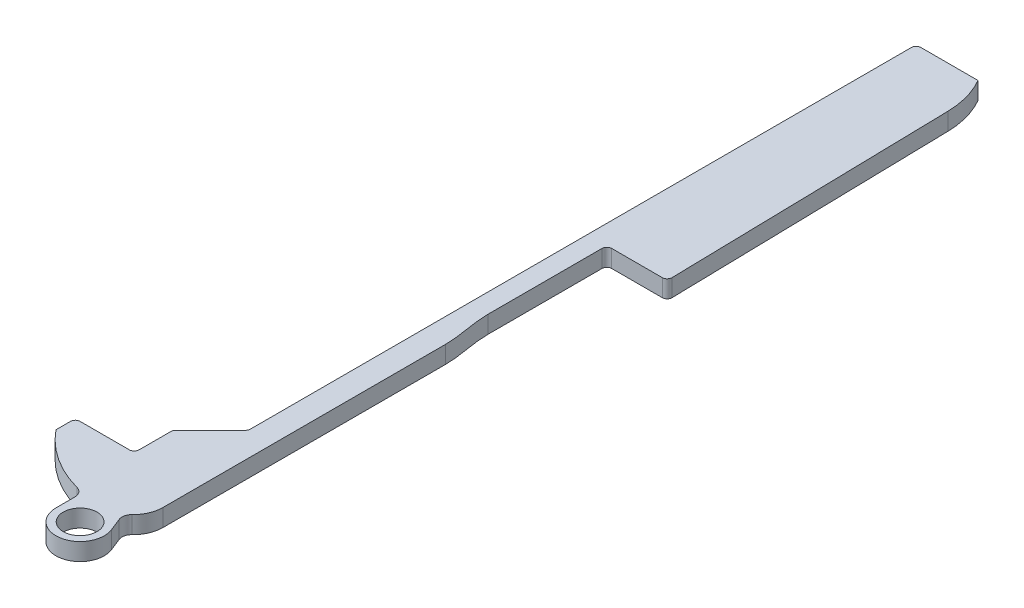
ISO-10303-21;
HEADER;
FILE_DESCRIPTION(('STEP AP214'),'2;1');
FILE_NAME('part.step','',(''),(''),'','','');
FILE_SCHEMA(('AUTOMOTIVE_DESIGN { 1 0 10303 214 1 1 1 1 }'));
ENDSEC;
DATA;
#1=APPLICATION_CONTEXT('core data for automotive mechanical design processes');
#2=APPLICATION_PROTOCOL_DEFINITION('international standard','automotive_design',2000,#1);
#3=PRODUCT_CONTEXT('',#1,'mechanical');
#4=PRODUCT('Part','Part','',(#3));
#5=PRODUCT_RELATED_PRODUCT_CATEGORY('part','',(#4));
#6=PRODUCT_DEFINITION_FORMATION('','',#4);
#7=PRODUCT_DEFINITION_CONTEXT('part definition',#1,'design');
#8=PRODUCT_DEFINITION('design','',#6,#7);
#9=PRODUCT_DEFINITION_SHAPE('','',#8);
#10=(LENGTH_UNIT() NAMED_UNIT(*) SI_UNIT(.MILLI.,.METRE.));
#11=(NAMED_UNIT(*) PLANE_ANGLE_UNIT() SI_UNIT($,.RADIAN.));
#12=(NAMED_UNIT(*) SI_UNIT($,.STERADIAN.) SOLID_ANGLE_UNIT());
#13=UNCERTAINTY_MEASURE_WITH_UNIT(LENGTH_MEASURE(1.E-05),#10,'distance_accuracy_value','');
#14=(GEOMETRIC_REPRESENTATION_CONTEXT(3) GLOBAL_UNCERTAINTY_ASSIGNED_CONTEXT((#13)) GLOBAL_UNIT_ASSIGNED_CONTEXT((#10,
#11,#12)) REPRESENTATION_CONTEXT('',''));
#15=CARTESIAN_POINT('',(0.,0.,0.));
#16=DIRECTION('',(0.,0.,1.));
#17=DIRECTION('',(1.,0.,0.));
#18=AXIS2_PLACEMENT_3D('',#15,#16,#17);
#19=CARTESIAN_POINT('',(9.43,1.8,-12.1305444444443));
#20=DIRECTION('',(0.,-1.,0.));
#21=DIRECTION('',(0.,0.,-1.));
#22=AXIS2_PLACEMENT_3D('',#19,#20,#21);
#23=CYLINDRICAL_SURFACE('',#22,12.1305444444443);
#24=CARTESIAN_POINT('',(9.43,0.,-12.1305444444443));
#25=DIRECTION('',(0.,1.,0.));
#26=DIRECTION('',(0.,0.,-1.));
#27=AXIS2_PLACEMENT_3D('',#24,#25,#26);
#28=CIRCLE('',#27,12.1305444444443);
#29=CARTESIAN_POINT('',(0.,0.,-4.5));
#30=VERTEX_POINT('',#29);
#31=CARTESIAN_POINT('',(6.2612229838993,0.,-0.421190886673872));
#32=VERTEX_POINT('',#31);
#33=EDGE_CURVE('E242',#30,#32,#28,.T.);
#34=ORIENTED_EDGE('',*,*,#33,.T.);
#35=DIRECTION('',(0.,-1.,0.));
#36=VECTOR('',#35,1.);
#37=CARTESIAN_POINT('',(6.2612229838993,1.8,-0.42119088667387));
#38=LINE('',#37,#36);
#39=CARTESIAN_POINT('',(6.2612229838993,1.8,-0.421190886673872));
#40=VERTEX_POINT('',#39);
#41=EDGE_CURVE('E326',#32,#40,#38,.F.);
#42=ORIENTED_EDGE('',*,*,#41,.T.);
#43=CARTESIAN_POINT('',(9.43,1.8,-12.1305444444443));
#44=DIRECTION('',(0.,1.,0.));
#45=DIRECTION('',(0.,0.,-1.));
#46=AXIS2_PLACEMENT_3D('',#43,#44,#45);
#47=CIRCLE('',#46,12.1305444444443);
#48=CARTESIAN_POINT('',(0.,1.8,-4.5));
#49=VERTEX_POINT('',#48);
#50=EDGE_CURVE('E244',#49,#40,#47,.T.);
#51=ORIENTED_EDGE('',*,*,#50,.F.);
#52=DIRECTION('',(0.,-1.,0.));
#53=VECTOR('',#52,1.);
#54=CARTESIAN_POINT('',(0.,1.8,-4.5));
#55=LINE('',#54,#53);
#56=EDGE_CURVE('E417',#49,#30,#55,.T.);
#57=ORIENTED_EDGE('',*,*,#56,.T.);
#58=EDGE_LOOP('',(#34,#42,#51,#57));
#59=FACE_BOUND('',#58,.T.);
#60=ADVANCED_FACE('F35',(#59),#23,.T.);
#61=CARTESIAN_POINT('',(9.43,1.8,-3.07));
#62=DIRECTION('',(0.,-1.,0.));
#63=DIRECTION('',(0.,0.,-1.));
#64=AXIS2_PLACEMENT_3D('',#61,#62,#63);
#65=CYLINDRICAL_SURFACE('',#64,3.07);
#66=CARTESIAN_POINT('',(9.43,1.8,-3.07));
#67=DIRECTION('',(0.,1.,0.));
#68=DIRECTION('',(0.,0.,-1.));
#69=AXIS2_PLACEMENT_3D('',#66,#67,#68);
#70=CIRCLE('',#69,3.07);
#71=CARTESIAN_POINT('',(11.5409002213602,1.8,-0.840874553673195));
#72=VERTEX_POINT('',#71);
#73=CARTESIAN_POINT('',(12.5,1.8,-3.07));
#74=VERTEX_POINT('',#73);
#75=EDGE_CURVE('E246',#72,#74,#70,.T.);
#76=ORIENTED_EDGE('',*,*,#75,.F.);
#77=DIRECTION('',(0.,-1.,0.));
#78=VECTOR('',#77,1.);
#79=CARTESIAN_POINT('',(11.5409002213602,1.8,-0.840874553673194));
#80=LINE('',#79,#78);
#81=CARTESIAN_POINT('',(11.5409002213602,0.,-0.840874553673195));
#82=VERTEX_POINT('',#81);
#83=EDGE_CURVE('E334',#72,#82,#80,.T.);
#84=ORIENTED_EDGE('',*,*,#83,.T.);
#85=CARTESIAN_POINT('',(9.43,0.,-3.07));
#86=DIRECTION('',(0.,1.,0.));
#87=DIRECTION('',(0.,0.,-1.));
#88=AXIS2_PLACEMENT_3D('',#85,#86,#87);
#89=CIRCLE('',#88,3.07);
#90=CARTESIAN_POINT('',(12.5,0.,-3.07));
#91=VERTEX_POINT('',#90);
#92=EDGE_CURVE('E456',#82,#91,#89,.T.);
#93=ORIENTED_EDGE('',*,*,#92,.T.);
#94=DIRECTION('',(0.,-1.,0.));
#95=VECTOR('',#94,1.);
#96=CARTESIAN_POINT('',(12.5,1.8,-3.07));
#97=LINE('',#96,#95);
#98=EDGE_CURVE('E402',#74,#91,#97,.T.);
#99=ORIENTED_EDGE('',*,*,#98,.F.);
#100=EDGE_LOOP('',(#76,#84,#93,#99));
#101=FACE_BOUND('',#100,.T.);
#102=ADVANCED_FACE('F272',(#101),#65,.T.);
#103=CARTESIAN_POINT('',(12.5,1.8,-32.33));
#104=DIRECTION('',(-1.,0.,0.));
#105=DIRECTION('',(0.,0.,1.));
#106=AXIS2_PLACEMENT_3D('',#103,#104,#105);
#107=PLANE('',#106);
#108=DIRECTION('',(0.,0.,-1.));
#109=VECTOR('',#108,1.);
#110=CARTESIAN_POINT('',(12.5,0.,-32.33));
#111=LINE('',#110,#109);
#112=CARTESIAN_POINT('',(12.5,0.,-32.33));
#113=VERTEX_POINT('',#112);
#114=EDGE_CURVE('E451',#91,#113,#111,.T.);
#115=ORIENTED_EDGE('',*,*,#114,.T.);
#116=DIRECTION('',(0.,-1.,0.));
#117=VECTOR('',#116,1.);
#118=CARTESIAN_POINT('',(12.5,1.8,-32.33));
#119=LINE('',#118,#117);
#120=CARTESIAN_POINT('',(12.5,1.8,-32.33));
#121=VERTEX_POINT('',#120);
#122=EDGE_CURVE('E405',#121,#113,#119,.T.);
#123=ORIENTED_EDGE('',*,*,#122,.F.);
#124=DIRECTION('',(0.,0.,-1.));
#125=VECTOR('',#124,1.);
#126=CARTESIAN_POINT('',(12.5,1.8,-32.33));
#127=LINE('',#126,#125);
#128=EDGE_CURVE('E249',#74,#121,#127,.T.);
#129=ORIENTED_EDGE('',*,*,#128,.F.);
#130=ORIENTED_EDGE('',*,*,#98,.T.);
#131=EDGE_LOOP('',(#115,#123,#129,#130));
#132=FACE_BOUND('',#131,.T.);
#133=ADVANCED_FACE('F267',(#132),#107,.F.);
#134=CARTESIAN_POINT('',(12.5,1.8,-32.33));
#135=CARTESIAN_POINT('',(12.5,1.8,-33.9722823380889));
#136=CARTESIAN_POINT('',(12.,1.8,-35.554764974261));
#137=CARTESIAN_POINT('',(12.,1.8,-37.18));
#138=B_SPLINE_CURVE_WITH_KNOTS('',3,(#134,#135,#136,#137),.UNSPECIFIED.,.F.,.F.,(4,4),(0.,1.),.UNSPECIFIED.);
#139=DIRECTION('',(0.,-1.,0.));
#140=VECTOR('',#139,1.);
#141=SURFACE_OF_LINEAR_EXTRUSION('',#138,#140);
#142=CARTESIAN_POINT('',(12.5,0.,-32.33));
#143=CARTESIAN_POINT('',(12.5,0.,-33.9722823380889));
#144=CARTESIAN_POINT('',(12.,0.,-35.554764974261));
#145=CARTESIAN_POINT('',(12.,0.,-37.18));
#146=B_SPLINE_CURVE_WITH_KNOTS('',3,(#142,#143,#144,#145),.UNSPECIFIED.,.F.,.F.,(4,4),(0.,1.),.UNSPECIFIED.);
#147=CARTESIAN_POINT('',(12.,0.,-37.18));
#148=VERTEX_POINT('',#147);
#149=EDGE_CURVE('E447',#113,#148,#146,.T.);
#150=ORIENTED_EDGE('',*,*,#149,.T.);
#151=DIRECTION('',(0.,-1.,0.));
#152=VECTOR('',#151,1.);
#153=CARTESIAN_POINT('',(12.,1.8,-37.18));
#154=LINE('',#153,#152);
#155=CARTESIAN_POINT('',(12.,1.8,-37.18));
#156=VERTEX_POINT('',#155);
#157=EDGE_CURVE('E408',#156,#148,#154,.T.);
#158=ORIENTED_EDGE('',*,*,#157,.F.);
#159=EDGE_CURVE('E251',#121,#156,#138,.T.);
#160=ORIENTED_EDGE('',*,*,#159,.F.);
#161=ORIENTED_EDGE('',*,*,#122,.T.);
#162=EDGE_LOOP('',(#150,#158,#160,#161));
#163=FACE_BOUND('',#162,.T.);
#164=ADVANCED_FACE('F262',(#163),#141,.F.);
#165=CARTESIAN_POINT('',(12.,1.8,-37.18));
#166=DIRECTION('',(-1.,0.,0.));
#167=DIRECTION('',(0.,0.,1.));
#168=AXIS2_PLACEMENT_3D('',#165,#166,#167);
#169=PLANE('',#168);
#170=DIRECTION('',(0.,0.,-1.));
#171=VECTOR('',#170,1.);
#172=CARTESIAN_POINT('',(12.,0.,-37.18));
#173=LINE('',#172,#171);
#174=CARTESIAN_POINT('',(12.,0.,-49.));
#175=VERTEX_POINT('',#174);
#176=EDGE_CURVE('E444',#148,#175,#173,.T.);
#177=ORIENTED_EDGE('',*,*,#176,.T.);
#178=DIRECTION('',(0.,-1.,0.));
#179=VECTOR('',#178,1.);
#180=CARTESIAN_POINT('',(12.,1.8,-49.));
#181=LINE('',#180,#179);
#182=CARTESIAN_POINT('',(12.,1.8,-49.));
#183=VERTEX_POINT('',#182);
#184=EDGE_CURVE('E395',#175,#183,#181,.F.);
#185=ORIENTED_EDGE('',*,*,#184,.T.);
#186=DIRECTION('',(0.,0.,-1.));
#187=VECTOR('',#186,1.);
#188=CARTESIAN_POINT('',(12.,1.8,-37.18));
#189=LINE('',#188,#187);
#190=EDGE_CURVE('E256',#156,#183,#189,.T.);
#191=ORIENTED_EDGE('',*,*,#190,.F.);
#192=ORIENTED_EDGE('',*,*,#157,.T.);
#193=EDGE_LOOP('',(#177,#185,#191,#192));
#194=FACE_BOUND('',#193,.T.);
#195=ADVANCED_FACE('F266',(#194),#169,.F.);
#196=CARTESIAN_POINT('',(18.25,1.8,-49.5));
#197=DIRECTION('',(0.,0.,-1.));
#198=DIRECTION('',(-1.,0.,0.));
#199=AXIS2_PLACEMENT_3D('',#196,#197,#198);
#200=PLANE('',#199);
#201=DIRECTION('',(1.,0.,0.));
#202=VECTOR('',#201,1.);
#203=CARTESIAN_POINT('',(18.25,1.8,-49.5));
#204=LINE('',#203,#202);
#205=CARTESIAN_POINT('',(12.5,1.8,-49.5));
#206=VERTEX_POINT('',#205);
#207=CARTESIAN_POINT('',(17.7389709464066,1.8,-49.5));
#208=VERTEX_POINT('',#207);
#209=EDGE_CURVE('E478',#206,#208,#204,.T.);
#210=ORIENTED_EDGE('',*,*,#209,.F.);
#211=DIRECTION('',(0.,-1.,0.));
#212=VECTOR('',#211,1.);
#213=CARTESIAN_POINT('',(12.5,0.,-49.5));
#214=LINE('',#213,#212);
#215=CARTESIAN_POINT('',(12.5,0.,-49.5));
#216=VERTEX_POINT('',#215);
#217=EDGE_CURVE('E397',#206,#216,#214,.T.);
#218=ORIENTED_EDGE('',*,*,#217,.T.);
#219=DIRECTION('',(1.,0.,0.));
#220=VECTOR('',#219,1.);
#221=CARTESIAN_POINT('',(18.25,0.,-49.5));
#222=LINE('',#221,#220);
#223=CARTESIAN_POINT('',(17.7389709464066,0.,-49.5));
#224=VERTEX_POINT('',#223);
#225=EDGE_CURVE('E441',#216,#224,#222,.T.);
#226=ORIENTED_EDGE('',*,*,#225,.T.);
#227=DIRECTION('',(0.,-1.,0.));
#228=VECTOR('',#227,1.);
#229=CARTESIAN_POINT('',(17.7389709464066,1.8,-49.5));
#230=LINE('',#229,#228);
#231=EDGE_CURVE('E400',#224,#208,#230,.F.);
#232=ORIENTED_EDGE('',*,*,#231,.T.);
#233=EDGE_LOOP('',(#210,#218,#226,#232));
#234=FACE_BOUND('',#233,.T.);
#235=ADVANCED_FACE('F492',(#234),#200,.F.);
#236=CARTESIAN_POINT('',(17.6019605823982,1.8,-79.1992260441899));
#237=DIRECTION('',(-0.999762027079909,0.,0.0218148850345542));
#238=DIRECTION('',(0.0218148850345542,0.,0.999762027079909));
#239=AXIS2_PLACEMENT_3D('',#236,#237,#238);
#240=PLANE('',#239);
#241=DIRECTION('',(-0.0218148850345542,0.,-0.999762027079909));
#242=VECTOR('',#241,1.);
#243=CARTESIAN_POINT('',(17.6019605823982,1.8,-79.1992260441899));
#244=LINE('',#243,#242);
#245=CARTESIAN_POINT('',(18.2388519599465,1.8,-50.0109074425173));
#246=VERTEX_POINT('',#245);
#247=CARTESIAN_POINT('',(17.6019605823982,1.8,-79.1992260441899));
#248=VERTEX_POINT('',#247);
#249=EDGE_CURVE('E477',#246,#248,#244,.T.);
#250=ORIENTED_EDGE('',*,*,#249,.F.);
#251=DIRECTION('',(0.,-1.,0.));
#252=VECTOR('',#251,1.);
#253=CARTESIAN_POINT('',(18.2388519599465,1.8,-50.0109074425173));
#254=LINE('',#253,#252);
#255=CARTESIAN_POINT('',(18.2388519599465,0.,-50.0109074425173));
#256=VERTEX_POINT('',#255);
#257=EDGE_CURVE('E392',#246,#256,#254,.T.);
#258=ORIENTED_EDGE('',*,*,#257,.T.);
#259=DIRECTION('',(-0.0218148850345542,0.,-0.999762027079909));
#260=VECTOR('',#259,1.);
#261=CARTESIAN_POINT('',(17.6019605823982,0.,-79.1992260441899));
#262=LINE('',#261,#260);
#263=CARTESIAN_POINT('',(17.6019605823982,0.,-79.1992260441899));
#264=VERTEX_POINT('',#263);
#265=EDGE_CURVE('E439',#256,#264,#262,.T.);
#266=ORIENTED_EDGE('',*,*,#265,.T.);
#267=DIRECTION('',(0.,-1.,0.));
#268=VECTOR('',#267,1.);
#269=CARTESIAN_POINT('',(17.6019605823982,1.8,-79.1992260441899));
#270=LINE('',#269,#268);
#271=EDGE_CURVE('E411',#248,#264,#270,.T.);
#272=ORIENTED_EDGE('',*,*,#271,.F.);
#273=EDGE_LOOP('',(#250,#258,#266,#272));
#274=FACE_BOUND('',#273,.T.);
#275=ADVANCED_FACE('F501',(#274),#240,.F.);
#276=CARTESIAN_POINT('',(8.60410233867904,1.8,-79.0028920788789));
#277=DIRECTION('',(0.,-1.,0.));
#278=DIRECTION('',(0.,0.,-1.));
#279=AXIS2_PLACEMENT_3D('',#276,#277,#278);
#280=CYLINDRICAL_SURFACE('',#279,9.);
#281=CARTESIAN_POINT('',(8.60410233867904,0.,-79.0028920788789));
#282=DIRECTION('',(0.,1.,0.));
#283=DIRECTION('',(0.,0.,1.));
#284=AXIS2_PLACEMENT_3D('',#281,#282,#283);
#285=CIRCLE('',#284,9.);
#286=CARTESIAN_POINT('',(16.4,0.,-83.5));
#287=VERTEX_POINT('',#286);
#288=EDGE_CURVE('E437',#264,#287,#285,.T.);
#289=ORIENTED_EDGE('',*,*,#288,.T.);
#290=DIRECTION('',(0.,-1.,0.));
#291=VECTOR('',#290,1.);
#292=CARTESIAN_POINT('',(16.4,1.8,-83.5));
#293=LINE('',#292,#291);
#294=CARTESIAN_POINT('',(16.4,1.8,-83.5));
#295=VERTEX_POINT('',#294);
#296=EDGE_CURVE('E414',#295,#287,#293,.T.);
#297=ORIENTED_EDGE('',*,*,#296,.F.);
#298=CARTESIAN_POINT('',(8.60410233867904,1.8,-79.0028920788789));
#299=DIRECTION('',(0.,1.,0.));
#300=DIRECTION('',(0.,0.,1.));
#301=AXIS2_PLACEMENT_3D('',#298,#299,#300);
#302=CIRCLE('',#301,9.);
#303=EDGE_CURVE('E475',#248,#295,#302,.T.);
#304=ORIENTED_EDGE('',*,*,#303,.F.);
#305=ORIENTED_EDGE('',*,*,#271,.T.);
#306=EDGE_LOOP('',(#289,#297,#304,#305));
#307=FACE_BOUND('',#306,.T.);
#308=ADVANCED_FACE('F508',(#307),#280,.T.);
#309=CARTESIAN_POINT('',(10.,1.8,-83.5));
#310=DIRECTION('',(0.,0.,1.));
#311=DIRECTION('',(1.,0.,0.));
#312=AXIS2_PLACEMENT_3D('',#309,#310,#311);
#313=PLANE('',#312);
#314=DIRECTION('',(-1.,0.,0.));
#315=VECTOR('',#314,1.);
#316=CARTESIAN_POINT('',(10.,0.,-83.5));
#317=LINE('',#316,#315);
#318=CARTESIAN_POINT('',(10.5,0.,-83.5));
#319=VERTEX_POINT('',#318);
#320=EDGE_CURVE('E434',#287,#319,#317,.T.);
#321=ORIENTED_EDGE('',*,*,#320,.T.);
#322=DIRECTION('',(0.,-1.,0.));
#323=VECTOR('',#322,1.);
#324=CARTESIAN_POINT('',(10.5,1.8,-83.5));
#325=LINE('',#324,#323);
#326=CARTESIAN_POINT('',(10.5,1.8,-83.5));
#327=VERTEX_POINT('',#326);
#328=EDGE_CURVE('E354',#319,#327,#325,.F.);
#329=ORIENTED_EDGE('',*,*,#328,.T.);
#330=DIRECTION('',(-1.,0.,0.));
#331=VECTOR('',#330,1.);
#332=CARTESIAN_POINT('',(10.,1.8,-83.5));
#333=LINE('',#332,#331);
#334=EDGE_CURVE('E472',#295,#327,#333,.T.);
#335=ORIENTED_EDGE('',*,*,#334,.F.);
#336=ORIENTED_EDGE('',*,*,#296,.T.);
#337=EDGE_LOOP('',(#321,#329,#335,#336));
#338=FACE_BOUND('',#337,.T.);
#339=ADVANCED_FACE('F511',(#338),#313,.F.);
#340=CARTESIAN_POINT('',(10.,1.8,-14.4));
#341=DIRECTION('',(1.,0.,0.));
#342=DIRECTION('',(0.,0.,-1.));
#343=AXIS2_PLACEMENT_3D('',#340,#341,#342);
#344=PLANE('',#343);
#345=DIRECTION('',(0.,0.,1.));
#346=VECTOR('',#345,1.);
#347=CARTESIAN_POINT('',(10.,0.,-14.4));
#348=LINE('',#347,#346);
#349=CARTESIAN_POINT('',(10.,0.,-83.));
#350=VERTEX_POINT('',#349);
#351=CARTESIAN_POINT('',(10.,0.,-14.6071067811865));
#352=VERTEX_POINT('',#351);
#353=EDGE_CURVE('E431',#350,#352,#348,.T.);
#354=ORIENTED_EDGE('',*,*,#353,.T.);
#355=DIRECTION('',(0.,-1.,0.));
#356=VECTOR('',#355,1.);
#357=CARTESIAN_POINT('',(10.,1.8,-14.6071067811865));
#358=LINE('',#357,#356);
#359=CARTESIAN_POINT('',(10.,1.8,-14.6071067811865));
#360=VERTEX_POINT('',#359);
#361=EDGE_CURVE('E366',#352,#360,#358,.F.);
#362=ORIENTED_EDGE('',*,*,#361,.T.);
#363=DIRECTION('',(0.,0.,1.));
#364=VECTOR('',#363,1.);
#365=CARTESIAN_POINT('',(10.,1.8,-14.4));
#366=LINE('',#365,#364);
#367=CARTESIAN_POINT('',(10.,1.8,-83.));
#368=VERTEX_POINT('',#367);
#369=EDGE_CURVE('E469',#368,#360,#366,.T.);
#370=ORIENTED_EDGE('',*,*,#369,.F.);
#371=DIRECTION('',(0.,-1.,0.));
#372=VECTOR('',#371,1.);
#373=CARTESIAN_POINT('',(10.,1.8,-83.));
#374=LINE('',#373,#372);
#375=EDGE_CURVE('E368',#368,#350,#374,.T.);
#376=ORIENTED_EDGE('',*,*,#375,.T.);
#377=EDGE_LOOP('',(#354,#362,#370,#376));
#378=FACE_BOUND('',#377,.T.);
#379=ADVANCED_FACE('F517',(#378),#344,.F.);
#380=CARTESIAN_POINT('',(6.1,1.8,-10.5));
#381=DIRECTION('',(0.707106781186546,0.,0.707106781186549));
#382=DIRECTION('',(0.707106781186549,0.,-0.707106781186546));
#383=AXIS2_PLACEMENT_3D('',#380,#381,#382);
#384=PLANE('',#383);
#385=DIRECTION('',(-0.707106781186549,0.,0.707106781186546));
#386=VECTOR('',#385,1.);
#387=CARTESIAN_POINT('',(6.1,1.8,-10.5));
#388=LINE('',#387,#386);
#389=CARTESIAN_POINT('',(9.85355339059327,1.8,-14.2535533905933));
#390=VERTEX_POINT('',#389);
#391=CARTESIAN_POINT('',(6.24644660940673,1.8,-10.6464466094067));
#392=VERTEX_POINT('',#391);
#393=EDGE_CURVE('E466',#390,#392,#388,.T.);
#394=ORIENTED_EDGE('',*,*,#393,.F.);
#395=DIRECTION('',(0.,-1.,0.));
#396=VECTOR('',#395,1.);
#397=CARTESIAN_POINT('',(9.85355339059327,0.,-14.2535533905933));
#398=LINE('',#397,#396);
#399=CARTESIAN_POINT('',(9.85355339059327,0.,-14.2535533905933));
#400=VERTEX_POINT('',#399);
#401=EDGE_CURVE('E371',#390,#400,#398,.T.);
#402=ORIENTED_EDGE('',*,*,#401,.T.);
#403=DIRECTION('',(-0.707106781186549,0.,0.707106781186546));
#404=VECTOR('',#403,1.);
#405=CARTESIAN_POINT('',(6.1,0.,-10.5));
#406=LINE('',#405,#404);
#407=CARTESIAN_POINT('',(6.24644660940673,0.,-10.6464466094067));
#408=VERTEX_POINT('',#407);
#409=EDGE_CURVE('E428',#400,#408,#406,.T.);
#410=ORIENTED_EDGE('',*,*,#409,.T.);
#411=DIRECTION('',(0.,-1.,0.));
#412=VECTOR('',#411,1.);
#413=CARTESIAN_POINT('',(6.24644660940673,1.8,-10.6464466094067));
#414=LINE('',#413,#412);
#415=EDGE_CURVE('E374',#408,#392,#414,.F.);
#416=ORIENTED_EDGE('',*,*,#415,.T.);
#417=EDGE_LOOP('',(#394,#402,#410,#416));
#418=FACE_BOUND('',#417,.T.);
#419=ADVANCED_FACE('F524',(#418),#384,.F.);
#420=CARTESIAN_POINT('',(6.1,1.8,-6.5));
#421=DIRECTION('',(1.,0.,0.));
#422=DIRECTION('',(0.,0.,-1.));
#423=AXIS2_PLACEMENT_3D('',#420,#421,#422);
#424=PLANE('',#423);
#425=DIRECTION('',(0.,0.,1.));
#426=VECTOR('',#425,1.);
#427=CARTESIAN_POINT('',(6.1,1.8,-6.5));
#428=LINE('',#427,#426);
#429=CARTESIAN_POINT('',(6.1,1.8,-10.2928932188135));
#430=VERTEX_POINT('',#429);
#431=CARTESIAN_POINT('',(6.1,1.8,-7.));
#432=VERTEX_POINT('',#431);
#433=EDGE_CURVE('E463',#430,#432,#428,.T.);
#434=ORIENTED_EDGE('',*,*,#433,.F.);
#435=DIRECTION('',(0.,-1.,0.));
#436=VECTOR('',#435,1.);
#437=CARTESIAN_POINT('',(6.1,1.8,-10.2928932188135));
#438=LINE('',#437,#436);
#439=CARTESIAN_POINT('',(6.1,0.,-10.2928932188135));
#440=VERTEX_POINT('',#439);
#441=EDGE_CURVE('E361',#430,#440,#438,.T.);
#442=ORIENTED_EDGE('',*,*,#441,.T.);
#443=DIRECTION('',(0.,0.,1.));
#444=VECTOR('',#443,1.);
#445=CARTESIAN_POINT('',(6.1,0.,-6.5));
#446=LINE('',#445,#444);
#447=CARTESIAN_POINT('',(6.1,0.,-7.));
#448=VERTEX_POINT('',#447);
#449=EDGE_CURVE('E425',#440,#448,#446,.T.);
#450=ORIENTED_EDGE('',*,*,#449,.T.);
#451=DIRECTION('',(0.,-1.,0.));
#452=VECTOR('',#451,1.);
#453=CARTESIAN_POINT('',(6.1,1.8,-7.));
#454=LINE('',#453,#452);
#455=EDGE_CURVE('E364',#448,#432,#454,.F.);
#456=ORIENTED_EDGE('',*,*,#455,.T.);
#457=EDGE_LOOP('',(#434,#442,#450,#456));
#458=FACE_BOUND('',#457,.T.);
#459=ADVANCED_FACE('F531',(#458),#424,.F.);
#460=CARTESIAN_POINT('',(0.,1.8,-6.5));
#461=DIRECTION('',(0.,0.,1.));
#462=DIRECTION('',(1.,0.,0.));
#463=AXIS2_PLACEMENT_3D('',#460,#461,#462);
#464=PLANE('',#463);
#465=DIRECTION('',(-1.,0.,0.));
#466=VECTOR('',#465,1.);
#467=CARTESIAN_POINT('',(0.,1.8,-6.5));
#468=LINE('',#467,#466);
#469=CARTESIAN_POINT('',(5.6,1.8,-6.5));
#470=VERTEX_POINT('',#469);
#471=CARTESIAN_POINT('',(0.5,1.8,-6.5));
#472=VERTEX_POINT('',#471);
#473=EDGE_CURVE('E460',#470,#472,#468,.T.);
#474=ORIENTED_EDGE('',*,*,#473,.F.);
#475=DIRECTION('',(0.,-1.,0.));
#476=VECTOR('',#475,1.);
#477=CARTESIAN_POINT('',(5.6,0.,-6.5));
#478=LINE('',#477,#476);
#479=CARTESIAN_POINT('',(5.6,0.,-6.5));
#480=VERTEX_POINT('',#479);
#481=EDGE_CURVE('E356',#470,#480,#478,.T.);
#482=ORIENTED_EDGE('',*,*,#481,.T.);
#483=DIRECTION('',(-1.,0.,0.));
#484=VECTOR('',#483,1.);
#485=CARTESIAN_POINT('',(0.,0.,-6.5));
#486=LINE('',#485,#484);
#487=CARTESIAN_POINT('',(0.5,0.,-6.5));
#488=VERTEX_POINT('',#487);
#489=EDGE_CURVE('E422',#480,#488,#486,.T.);
#490=ORIENTED_EDGE('',*,*,#489,.T.);
#491=DIRECTION('',(0.,-1.,0.));
#492=VECTOR('',#491,1.);
#493=CARTESIAN_POINT('',(0.5,1.8,-6.5));
#494=LINE('',#493,#492);
#495=EDGE_CURVE('E359',#488,#472,#494,.F.);
#496=ORIENTED_EDGE('',*,*,#495,.T.);
#497=EDGE_LOOP('',(#474,#482,#490,#496));
#498=FACE_BOUND('',#497,.T.);
#499=ADVANCED_FACE('F538',(#498),#464,.F.);
#500=CARTESIAN_POINT('',(0.,1.8,-4.5));
#501=DIRECTION('',(1.,0.,0.));
#502=DIRECTION('',(0.,0.,-1.));
#503=AXIS2_PLACEMENT_3D('',#500,#501,#502);
#504=PLANE('',#503);
#505=DIRECTION('',(0.,0.,1.));
#506=VECTOR('',#505,1.);
#507=CARTESIAN_POINT('',(0.,1.8,-4.5));
#508=LINE('',#507,#506);
#509=CARTESIAN_POINT('',(0.,1.8,-6.));
#510=VERTEX_POINT('',#509);
#511=EDGE_CURVE('E420',#510,#49,#508,.T.);
#512=ORIENTED_EDGE('',*,*,#511,.F.);
#513=DIRECTION('',(0.,-1.,0.));
#514=VECTOR('',#513,1.);
#515=CARTESIAN_POINT('',(0.,1.8,-6.));
#516=LINE('',#515,#514);
#517=CARTESIAN_POINT('',(0.,0.,-6.));
#518=VERTEX_POINT('',#517);
#519=EDGE_CURVE('E351',#510,#518,#516,.T.);
#520=ORIENTED_EDGE('',*,*,#519,.T.);
#521=DIRECTION('',(0.,0.,1.));
#522=VECTOR('',#521,1.);
#523=CARTESIAN_POINT('',(0.,0.,-4.5));
#524=LINE('',#523,#522);
#525=EDGE_CURVE('E247',#518,#30,#524,.T.);
#526=ORIENTED_EDGE('',*,*,#525,.T.);
#527=ORIENTED_EDGE('',*,*,#56,.F.);
#528=EDGE_LOOP('',(#512,#520,#526,#527));
#529=FACE_BOUND('',#528,.T.);
#530=ADVANCED_FACE('F545',(#529),#504,.F.);
#531=CARTESIAN_POINT('',(9.43,1.8,-12.1305444444443));
#532=DIRECTION('',(0.,-1.,0.));
#533=DIRECTION('',(0.,0.,-1.));
#534=AXIS2_PLACEMENT_3D('',#531,#532,#533);
#535=PLANE('',#534);
#536=ORIENTED_EDGE('',*,*,#50,.T.);
#537=CARTESIAN_POINT('',(6.00000000000001,1.8,0.544087597848991));
#538=DIRECTION('',(0.,-1.,0.));
#539=DIRECTION('',(0.,0.,-1.));
#540=AXIS2_PLACEMENT_3D('',#537,#538,#539);
#541=CIRCLE('',#540,1.);
#542=CARTESIAN_POINT('',(7.00000000000001,1.8,0.544087597848992));
#543=VERTEX_POINT('',#542);
#544=EDGE_CURVE('E329',#40,#543,#541,.T.);
#545=ORIENTED_EDGE('',*,*,#544,.T.);
#546=DIRECTION('',(0.,0.,-1.));
#547=VECTOR('',#546,1.);
#548=CARTESIAN_POINT('',(7.00000000000001,1.8,0.));
#549=LINE('',#548,#547);
#550=CARTESIAN_POINT('',(7.,1.8,2.49983254115866));
#551=VERTEX_POINT('',#550);
#552=EDGE_CURVE('E213',#551,#543,#549,.T.);
#553=ORIENTED_EDGE('',*,*,#552,.F.);
#554=CARTESIAN_POINT('',(9.50000000000001,1.8,2.49983254115866));
#555=DIRECTION('',(0.,-1.,0.));
#556=DIRECTION('',(0.,0.,-1.));
#557=AXIS2_PLACEMENT_3D('',#554,#555,#556);
#558=CIRCLE('',#557,2.5);
#559=CARTESIAN_POINT('',(11.8240453183332,1.8,1.57852186699192));
#560=VERTEX_POINT('',#559);
#561=EDGE_CURVE('E212',#560,#551,#558,.T.);
#562=ORIENTED_EDGE('',*,*,#561,.F.);
#563=DIRECTION('',(0.368524269666694,0.,0.929618127333278));
#564=VECTOR('',#563,1.);
#565=CARTESIAN_POINT('',(9.67743927925067,1.8,-3.8363830671635));
#566=LINE('',#565,#564);
#567=CARTESIAN_POINT('',(11.2988717426784,1.8,0.253749209911025));
#568=VERTEX_POINT('',#567);
#569=EDGE_CURVE('E204',#568,#560,#566,.T.);
#570=ORIENTED_EDGE('',*,*,#569,.F.);
#571=CARTESIAN_POINT('',(12.2284898700117,1.8,-0.11477505975567));
#572=DIRECTION('',(0.,-1.,0.));
#573=DIRECTION('',(0.,0.,-1.));
#574=AXIS2_PLACEMENT_3D('',#571,#572,#573);
#575=CIRCLE('',#574,1.);
#576=EDGE_CURVE('E11',#568,#72,#575,.T.);
#577=ORIENTED_EDGE('',*,*,#576,.T.);
#578=ORIENTED_EDGE('',*,*,#75,.T.);
#579=ORIENTED_EDGE('',*,*,#128,.T.);
#580=ORIENTED_EDGE('',*,*,#159,.T.);
#581=ORIENTED_EDGE('',*,*,#190,.T.);
#582=CARTESIAN_POINT('',(12.5,1.8,-49.));
#583=DIRECTION('',(0.,-1.,0.));
#584=DIRECTION('',(0.,0.,-1.));
#585=AXIS2_PLACEMENT_3D('',#582,#583,#584);
#586=CIRCLE('',#585,0.5);
#587=EDGE_CURVE('E347',#183,#206,#586,.T.);
#588=ORIENTED_EDGE('',*,*,#587,.T.);
#589=ORIENTED_EDGE('',*,*,#209,.T.);
#590=CARTESIAN_POINT('',(17.7389709464066,1.8,-50.));
#591=DIRECTION('',(0.,-1.,0.));
#592=DIRECTION('',(0.,0.,-1.));
#593=AXIS2_PLACEMENT_3D('',#590,#591,#592);
#594=CIRCLE('',#593,0.5);
#595=EDGE_CURVE('E376',#208,#246,#594,.F.);
#596=ORIENTED_EDGE('',*,*,#595,.T.);
#597=ORIENTED_EDGE('',*,*,#249,.T.);
#598=ORIENTED_EDGE('',*,*,#303,.T.);
#599=ORIENTED_EDGE('',*,*,#334,.T.);
#600=CARTESIAN_POINT('',(10.5,1.8,-83.));
#601=DIRECTION('',(0.,-1.,0.));
#602=DIRECTION('',(0.,0.,-1.));
#603=AXIS2_PLACEMENT_3D('',#600,#601,#602);
#604=CIRCLE('',#603,0.5);
#605=EDGE_CURVE('E380',#327,#368,#604,.F.);
#606=ORIENTED_EDGE('',*,*,#605,.T.);
#607=ORIENTED_EDGE('',*,*,#369,.T.);
#608=CARTESIAN_POINT('',(9.5,1.8,-14.6071067811865));
#609=DIRECTION('',(0.,-1.,0.));
#610=DIRECTION('',(0.,0.,-1.));
#611=AXIS2_PLACEMENT_3D('',#608,#609,#610);
#612=CIRCLE('',#611,0.5);
#613=EDGE_CURVE('E343',#360,#390,#612,.T.);
#614=ORIENTED_EDGE('',*,*,#613,.T.);
#615=ORIENTED_EDGE('',*,*,#393,.T.);
#616=CARTESIAN_POINT('',(6.6,1.8,-10.2928932188135));
#617=DIRECTION('',(0.,-1.,0.));
#618=DIRECTION('',(0.,0.,-1.));
#619=AXIS2_PLACEMENT_3D('',#616,#617,#618);
#620=CIRCLE('',#619,0.5);
#621=EDGE_CURVE('E378',#392,#430,#620,.F.);
#622=ORIENTED_EDGE('',*,*,#621,.T.);
#623=ORIENTED_EDGE('',*,*,#433,.T.);
#624=CARTESIAN_POINT('',(5.6,1.8,-7.));
#625=DIRECTION('',(0.,-1.,0.));
#626=DIRECTION('',(0.,0.,-1.));
#627=AXIS2_PLACEMENT_3D('',#624,#625,#626);
#628=CIRCLE('',#627,0.5);
#629=EDGE_CURVE('E339',#432,#470,#628,.T.);
#630=ORIENTED_EDGE('',*,*,#629,.T.);
#631=ORIENTED_EDGE('',*,*,#473,.T.);
#632=CARTESIAN_POINT('',(0.5,1.8,-6.));
#633=DIRECTION('',(0.,-1.,0.));
#634=DIRECTION('',(0.,0.,-1.));
#635=AXIS2_PLACEMENT_3D('',#632,#633,#634);
#636=CIRCLE('',#635,0.5);
#637=EDGE_CURVE('E382',#472,#510,#636,.F.);
#638=ORIENTED_EDGE('',*,*,#637,.T.);
#639=ORIENTED_EDGE('',*,*,#511,.T.);
#640=EDGE_LOOP('',(#536,#545,#553,#562,#570,#577,#578,#579,#580,#581,#588,#589,#596,#597,#598,
#599,#606,#607,#614,#615,#622,#623,#630,#631,#638,#639));
#641=FACE_BOUND('',#640,.T.);
#642=CARTESIAN_POINT('',(9.50000000000001,1.8,2.49983254115866));
#643=DIRECTION('',(0.,-1.,0.));
#644=DIRECTION('',(0.,0.,-1.));
#645=AXIS2_PLACEMENT_3D('',#642,#643,#644);
#646=CIRCLE('',#645,1.75);
#647=CARTESIAN_POINT('',(9.50000000000001,1.8,0.749832541158658));
#648=VERTEX_POINT('',#647);
#649=EDGE_CURVE('E221',#648,#648,#646,.T.);
#650=ORIENTED_EDGE('',*,*,#649,.T.);
#651=EDGE_LOOP('',(#650));
#652=FACE_BOUND('',#651,.T.);
#653=ADVANCED_FACE('F225',(#641,#652),#535,.F.);
#654=CARTESIAN_POINT('',(9.43,0.,-12.1305444444443));
#655=DIRECTION('',(0.,-1.,0.));
#656=DIRECTION('',(0.,0.,-1.));
#657=AXIS2_PLACEMENT_3D('',#654,#655,#656);
#658=PLANE('',#657);
#659=ORIENTED_EDGE('',*,*,#92,.F.);
#660=CARTESIAN_POINT('',(12.2284898700117,0.,-0.11477505975567));
#661=DIRECTION('',(0.,-1.,0.));
#662=DIRECTION('',(0.,0.,-1.));
#663=AXIS2_PLACEMENT_3D('',#660,#661,#662);
#664=CIRCLE('',#663,1.);
#665=CARTESIAN_POINT('',(11.2988717426784,0.,0.253749209911025));
#666=VERTEX_POINT('',#665);
#667=EDGE_CURVE('E43',#82,#666,#664,.F.);
#668=ORIENTED_EDGE('',*,*,#667,.T.);
#669=DIRECTION('',(0.368524269666694,0.,0.929618127333278));
#670=VECTOR('',#669,1.);
#671=CARTESIAN_POINT('',(9.67743927925067,0.,-3.8363830671635));
#672=LINE('',#671,#670);
#673=CARTESIAN_POINT('',(11.8240453183332,0.,1.57852186699192));
#674=VERTEX_POINT('',#673);
#675=EDGE_CURVE('E236',#666,#674,#672,.T.);
#676=ORIENTED_EDGE('',*,*,#675,.T.);
#677=CARTESIAN_POINT('',(9.50000000000001,0.,2.49983254115866));
#678=DIRECTION('',(0.,-1.,0.));
#679=DIRECTION('',(0.,0.,-1.));
#680=AXIS2_PLACEMENT_3D('',#677,#678,#679);
#681=CIRCLE('',#680,2.5);
#682=CARTESIAN_POINT('',(7.,0.,2.49983254115866));
#683=VERTEX_POINT('',#682);
#684=EDGE_CURVE('E219',#674,#683,#681,.T.);
#685=ORIENTED_EDGE('',*,*,#684,.T.);
#686=DIRECTION('',(0.,0.,-1.));
#687=VECTOR('',#686,1.);
#688=CARTESIAN_POINT('',(7.00000000000001,0.,0.));
#689=LINE('',#688,#687);
#690=CARTESIAN_POINT('',(7.00000000000001,0.,0.544087597848992));
#691=VERTEX_POINT('',#690);
#692=EDGE_CURVE('E233',#683,#691,#689,.T.);
#693=ORIENTED_EDGE('',*,*,#692,.T.);
#694=CARTESIAN_POINT('',(6.00000000000001,0.,0.544087597848991));
#695=DIRECTION('',(0.,-1.,0.));
#696=DIRECTION('',(0.,0.,-1.));
#697=AXIS2_PLACEMENT_3D('',#694,#695,#696);
#698=CIRCLE('',#697,1.);
#699=EDGE_CURVE('E323',#691,#32,#698,.F.);
#700=ORIENTED_EDGE('',*,*,#699,.T.);
#701=ORIENTED_EDGE('',*,*,#33,.F.);
#702=ORIENTED_EDGE('',*,*,#525,.F.);
#703=CARTESIAN_POINT('',(0.5,0.,-6.));
#704=DIRECTION('',(0.,-1.,0.));
#705=DIRECTION('',(0.,0.,-1.));
#706=AXIS2_PLACEMENT_3D('',#703,#704,#705);
#707=CIRCLE('',#706,0.5);
#708=EDGE_CURVE('E390',#518,#488,#707,.T.);
#709=ORIENTED_EDGE('',*,*,#708,.T.);
#710=ORIENTED_EDGE('',*,*,#489,.F.);
#711=CARTESIAN_POINT('',(5.6,0.,-7.));
#712=DIRECTION('',(0.,-1.,0.));
#713=DIRECTION('',(0.,0.,-1.));
#714=AXIS2_PLACEMENT_3D('',#711,#712,#713);
#715=CIRCLE('',#714,0.5);
#716=EDGE_CURVE('E341',#480,#448,#715,.F.);
#717=ORIENTED_EDGE('',*,*,#716,.T.);
#718=ORIENTED_EDGE('',*,*,#449,.F.);
#719=CARTESIAN_POINT('',(6.6,0.,-10.2928932188135));
#720=DIRECTION('',(0.,-1.,0.));
#721=DIRECTION('',(0.,0.,-1.));
#722=AXIS2_PLACEMENT_3D('',#719,#720,#721);
#723=CIRCLE('',#722,0.5);
#724=EDGE_CURVE('E386',#440,#408,#723,.T.);
#725=ORIENTED_EDGE('',*,*,#724,.T.);
#726=ORIENTED_EDGE('',*,*,#409,.F.);
#727=CARTESIAN_POINT('',(9.5,0.,-14.6071067811865));
#728=DIRECTION('',(0.,-1.,0.));
#729=DIRECTION('',(0.,0.,-1.));
#730=AXIS2_PLACEMENT_3D('',#727,#728,#729);
#731=CIRCLE('',#730,0.5);
#732=EDGE_CURVE('E345',#400,#352,#731,.F.);
#733=ORIENTED_EDGE('',*,*,#732,.T.);
#734=ORIENTED_EDGE('',*,*,#353,.F.);
#735=CARTESIAN_POINT('',(10.5,0.,-83.));
#736=DIRECTION('',(0.,-1.,0.));
#737=DIRECTION('',(0.,0.,-1.));
#738=AXIS2_PLACEMENT_3D('',#735,#736,#737);
#739=CIRCLE('',#738,0.5);
#740=EDGE_CURVE('E388',#350,#319,#739,.T.);
#741=ORIENTED_EDGE('',*,*,#740,.T.);
#742=ORIENTED_EDGE('',*,*,#320,.F.);
#743=ORIENTED_EDGE('',*,*,#288,.F.);
#744=ORIENTED_EDGE('',*,*,#265,.F.);
#745=CARTESIAN_POINT('',(17.7389709464066,0.,-50.));
#746=DIRECTION('',(0.,-1.,0.));
#747=DIRECTION('',(0.,0.,-1.));
#748=AXIS2_PLACEMENT_3D('',#745,#746,#747);
#749=CIRCLE('',#748,0.5);
#750=EDGE_CURVE('E384',#256,#224,#749,.T.);
#751=ORIENTED_EDGE('',*,*,#750,.T.);
#752=ORIENTED_EDGE('',*,*,#225,.F.);
#753=CARTESIAN_POINT('',(12.5,0.,-49.));
#754=DIRECTION('',(0.,-1.,0.));
#755=DIRECTION('',(0.,0.,-1.));
#756=AXIS2_PLACEMENT_3D('',#753,#754,#755);
#757=CIRCLE('',#756,0.5);
#758=EDGE_CURVE('E349',#216,#175,#757,.F.);
#759=ORIENTED_EDGE('',*,*,#758,.T.);
#760=ORIENTED_EDGE('',*,*,#176,.F.);
#761=ORIENTED_EDGE('',*,*,#149,.F.);
#762=ORIENTED_EDGE('',*,*,#114,.F.);
#763=EDGE_LOOP('',(#659,#668,#676,#685,#693,#700,#701,#702,#709,#710,#717,#718,#725,#726,#733,
#734,#741,#742,#743,#744,#751,#752,#759,#760,#761,#762));
#764=FACE_BOUND('',#763,.T.);
#765=CARTESIAN_POINT('',(9.50000000000001,0.,2.49983254115866));
#766=DIRECTION('',(0.,-1.,0.));
#767=DIRECTION('',(0.,0.,-1.));
#768=AXIS2_PLACEMENT_3D('',#765,#766,#767);
#769=CIRCLE('',#768,1.75);
#770=CARTESIAN_POINT('',(9.50000000000001,0.,0.749832541158658));
#771=VERTEX_POINT('',#770);
#772=EDGE_CURVE('E239',#771,#771,#769,.T.);
#773=ORIENTED_EDGE('',*,*,#772,.F.);
#774=EDGE_LOOP('',(#773));
#775=FACE_BOUND('',#774,.T.);
#776=ADVANCED_FACE('F284',(#764,#775),#658,.T.);
#777=CARTESIAN_POINT('',(12.5,1.8,-49.));
#778=DIRECTION('',(0.,1.,0.));
#779=DIRECTION('',(0.,0.,1.));
#780=AXIS2_PLACEMENT_3D('',#777,#778,#779);
#781=CYLINDRICAL_SURFACE('',#780,0.5);
#782=ORIENTED_EDGE('',*,*,#587,.F.);
#783=ORIENTED_EDGE('',*,*,#184,.F.);
#784=ORIENTED_EDGE('',*,*,#758,.F.);
#785=ORIENTED_EDGE('',*,*,#217,.F.);
#786=EDGE_LOOP('',(#782,#783,#784,#785));
#787=FACE_BOUND('',#786,.T.);
#788=ADVANCED_FACE('F280',(#787),#781,.F.);
#789=CARTESIAN_POINT('',(17.7389709464066,1.8,-50.));
#790=DIRECTION('',(0.,-1.,0.));
#791=DIRECTION('',(0.,0.,-1.));
#792=AXIS2_PLACEMENT_3D('',#789,#790,#791);
#793=CYLINDRICAL_SURFACE('',#792,0.5);
#794=ORIENTED_EDGE('',*,*,#595,.F.);
#795=ORIENTED_EDGE('',*,*,#231,.F.);
#796=ORIENTED_EDGE('',*,*,#750,.F.);
#797=ORIENTED_EDGE('',*,*,#257,.F.);
#798=EDGE_LOOP('',(#794,#795,#796,#797));
#799=FACE_BOUND('',#798,.T.);
#800=ADVANCED_FACE('F283',(#799),#793,.T.);
#801=CARTESIAN_POINT('',(9.5,1.8,-14.6071067811865));
#802=DIRECTION('',(0.,1.,0.));
#803=DIRECTION('',(0.,0.,1.));
#804=AXIS2_PLACEMENT_3D('',#801,#802,#803);
#805=CYLINDRICAL_SURFACE('',#804,0.5);
#806=ORIENTED_EDGE('',*,*,#613,.F.);
#807=ORIENTED_EDGE('',*,*,#361,.F.);
#808=ORIENTED_EDGE('',*,*,#732,.F.);
#809=ORIENTED_EDGE('',*,*,#401,.F.);
#810=EDGE_LOOP('',(#806,#807,#808,#809));
#811=FACE_BOUND('',#810,.T.);
#812=ADVANCED_FACE('F288',(#811),#805,.F.);
#813=CARTESIAN_POINT('',(6.6,1.8,-10.2928932188135));
#814=DIRECTION('',(0.,-1.,0.));
#815=DIRECTION('',(0.,0.,-1.));
#816=AXIS2_PLACEMENT_3D('',#813,#814,#815);
#817=CYLINDRICAL_SURFACE('',#816,0.5);
#818=ORIENTED_EDGE('',*,*,#621,.F.);
#819=ORIENTED_EDGE('',*,*,#415,.F.);
#820=ORIENTED_EDGE('',*,*,#724,.F.);
#821=ORIENTED_EDGE('',*,*,#441,.F.);
#822=EDGE_LOOP('',(#818,#819,#820,#821));
#823=FACE_BOUND('',#822,.T.);
#824=ADVANCED_FACE('F292',(#823),#817,.T.);
#825=CARTESIAN_POINT('',(5.6,1.8,-7.));
#826=DIRECTION('',(0.,1.,0.));
#827=DIRECTION('',(0.,0.,1.));
#828=AXIS2_PLACEMENT_3D('',#825,#826,#827);
#829=CYLINDRICAL_SURFACE('',#828,0.5);
#830=ORIENTED_EDGE('',*,*,#629,.F.);
#831=ORIENTED_EDGE('',*,*,#455,.F.);
#832=ORIENTED_EDGE('',*,*,#716,.F.);
#833=ORIENTED_EDGE('',*,*,#481,.F.);
#834=EDGE_LOOP('',(#830,#831,#832,#833));
#835=FACE_BOUND('',#834,.T.);
#836=ADVANCED_FACE('F296',(#835),#829,.F.);
#837=CARTESIAN_POINT('',(10.5,1.8,-83.));
#838=DIRECTION('',(0.,-1.,0.));
#839=DIRECTION('',(0.,0.,-1.));
#840=AXIS2_PLACEMENT_3D('',#837,#838,#839);
#841=CYLINDRICAL_SURFACE('',#840,0.5);
#842=ORIENTED_EDGE('',*,*,#605,.F.);
#843=ORIENTED_EDGE('',*,*,#328,.F.);
#844=ORIENTED_EDGE('',*,*,#740,.F.);
#845=ORIENTED_EDGE('',*,*,#375,.F.);
#846=EDGE_LOOP('',(#842,#843,#844,#845));
#847=FACE_BOUND('',#846,.T.);
#848=ADVANCED_FACE('F300',(#847),#841,.T.);
#849=CARTESIAN_POINT('',(0.5,1.8,-6.));
#850=DIRECTION('',(0.,-1.,0.));
#851=DIRECTION('',(0.,0.,-1.));
#852=AXIS2_PLACEMENT_3D('',#849,#850,#851);
#853=CYLINDRICAL_SURFACE('',#852,0.5);
#854=ORIENTED_EDGE('',*,*,#637,.F.);
#855=ORIENTED_EDGE('',*,*,#495,.F.);
#856=ORIENTED_EDGE('',*,*,#708,.F.);
#857=ORIENTED_EDGE('',*,*,#519,.F.);
#858=EDGE_LOOP('',(#854,#855,#856,#857));
#859=FACE_BOUND('',#858,.T.);
#860=ADVANCED_FACE('F304',(#859),#853,.T.);
#861=CARTESIAN_POINT('',(7.00000000000001,1.8,0.));
#862=DIRECTION('',(-1.,0.,0.));
#863=DIRECTION('',(0.,0.,1.));
#864=AXIS2_PLACEMENT_3D('',#861,#862,#863);
#865=PLANE('',#864);
#866=ORIENTED_EDGE('',*,*,#552,.T.);
#867=DIRECTION('',(0.,-1.,0.));
#868=VECTOR('',#867,1.);
#869=CARTESIAN_POINT('',(7.00000000000001,1.8,0.544087597848992));
#870=LINE('',#869,#868);
#871=EDGE_CURVE('E324',#543,#691,#870,.T.);
#872=ORIENTED_EDGE('',*,*,#871,.T.);
#873=ORIENTED_EDGE('',*,*,#692,.F.);
#874=DIRECTION('',(0.,-1.,0.));
#875=VECTOR('',#874,1.);
#876=CARTESIAN_POINT('',(7.,1.8,2.49983254115866));
#877=LINE('',#876,#875);
#878=EDGE_CURVE('E220',#551,#683,#877,.T.);
#879=ORIENTED_EDGE('',*,*,#878,.F.);
#880=EDGE_LOOP('',(#866,#872,#873,#879));
#881=FACE_BOUND('',#880,.T.);
#882=ADVANCED_FACE('F307',(#881),#865,.T.);
#883=CARTESIAN_POINT('',(9.67743927925067,1.8,-3.8363830671635));
#884=DIRECTION('',(0.929618127333278,0.,-0.368524269666694));
#885=DIRECTION('',(-0.368524269666694,0.,-0.929618127333278));
#886=AXIS2_PLACEMENT_3D('',#883,#884,#885);
#887=PLANE('',#886);
#888=ORIENTED_EDGE('',*,*,#675,.F.);
#889=DIRECTION('',(0.,-1.,0.));
#890=VECTOR('',#889,1.);
#891=CARTESIAN_POINT('',(11.2988717426784,1.8,0.253749209911025));
#892=LINE('',#891,#890);
#893=EDGE_CURVE('E56',#666,#568,#892,.F.);
#894=ORIENTED_EDGE('',*,*,#893,.T.);
#895=ORIENTED_EDGE('',*,*,#569,.T.);
#896=DIRECTION('',(0.,-1.,0.));
#897=VECTOR('',#896,1.);
#898=CARTESIAN_POINT('',(11.8240453183332,1.8,1.57852186699192));
#899=LINE('',#898,#897);
#900=EDGE_CURVE('E207',#560,#674,#899,.T.);
#901=ORIENTED_EDGE('',*,*,#900,.T.);
#902=EDGE_LOOP('',(#888,#894,#895,#901));
#903=FACE_BOUND('',#902,.T.);
#904=ADVANCED_FACE('F206',(#903),#887,.T.);
#905=CARTESIAN_POINT('',(9.50000000000001,1.8,2.49983254115866));
#906=DIRECTION('',(0.,-1.,0.));
#907=DIRECTION('',(0.,0.,-1.));
#908=AXIS2_PLACEMENT_3D('',#905,#906,#907);
#909=CYLINDRICAL_SURFACE('',#908,2.5);
#910=ORIENTED_EDGE('',*,*,#684,.F.);
#911=ORIENTED_EDGE('',*,*,#900,.F.);
#912=ORIENTED_EDGE('',*,*,#561,.T.);
#913=ORIENTED_EDGE('',*,*,#878,.T.);
#914=EDGE_LOOP('',(#910,#911,#912,#913));
#915=FACE_BOUND('',#914,.T.);
#916=ADVANCED_FACE('F217',(#915),#909,.T.);
#917=CARTESIAN_POINT('',(9.50000000000001,1.8,2.49983254115866));
#918=DIRECTION('',(0.,-1.,0.));
#919=DIRECTION('',(0.,0.,-1.));
#920=AXIS2_PLACEMENT_3D('',#917,#918,#919);
#921=CYLINDRICAL_SURFACE('',#920,1.75);
#922=ORIENTED_EDGE('',*,*,#649,.F.);
#923=EDGE_LOOP('',(#922));
#924=FACE_BOUND('',#923,.T.);
#925=ORIENTED_EDGE('',*,*,#772,.T.);
#926=EDGE_LOOP('',(#925));
#927=FACE_BOUND('',#926,.T.);
#928=ADVANCED_FACE('F311',(#924,#927),#921,.F.);
#929=CARTESIAN_POINT('',(6.00000000000001,1.8,0.544087597848991));
#930=DIRECTION('',(0.,-1.,0.));
#931=DIRECTION('',(0.,0.,-1.));
#932=AXIS2_PLACEMENT_3D('',#929,#930,#931);
#933=CYLINDRICAL_SURFACE('',#932,1.);
#934=ORIENTED_EDGE('',*,*,#699,.F.);
#935=ORIENTED_EDGE('',*,*,#871,.F.);
#936=ORIENTED_EDGE('',*,*,#544,.F.);
#937=ORIENTED_EDGE('',*,*,#41,.F.);
#938=EDGE_LOOP('',(#934,#935,#936,#937));
#939=FACE_BOUND('',#938,.T.);
#940=ADVANCED_FACE('F309',(#939),#933,.F.);
#941=CARTESIAN_POINT('',(12.2284898700117,1.8,-0.11477505975567));
#942=DIRECTION('',(0.,-1.,0.));
#943=DIRECTION('',(0.,0.,-1.));
#944=AXIS2_PLACEMENT_3D('',#941,#942,#943);
#945=CYLINDRICAL_SURFACE('',#944,1.);
#946=ORIENTED_EDGE('',*,*,#576,.F.);
#947=ORIENTED_EDGE('',*,*,#893,.F.);
#948=ORIENTED_EDGE('',*,*,#667,.F.);
#949=ORIENTED_EDGE('',*,*,#83,.F.);
#950=EDGE_LOOP('',(#946,#947,#948,#949));
#951=FACE_BOUND('',#950,.T.);
#952=ADVANCED_FACE('F37',(#951),#945,.F.);
#953=CLOSED_SHELL('',(#60,#102,#133,#164,#195,#235,#275,#308,#339,#379,#419,#459,#499,#530,#653,
#776,#788,#800,#812,#824,#836,#848,#860,#882,#904,#916,#928,#940,#952));
#954=MANIFOLD_SOLID_BREP('B2',#953);
#955=ADVANCED_BREP_SHAPE_REPRESENTATION('',(#18,#954),#14);
#956=SHAPE_DEFINITION_REPRESENTATION(#9,#955);
ENDSEC;
END-ISO-10303-21;
